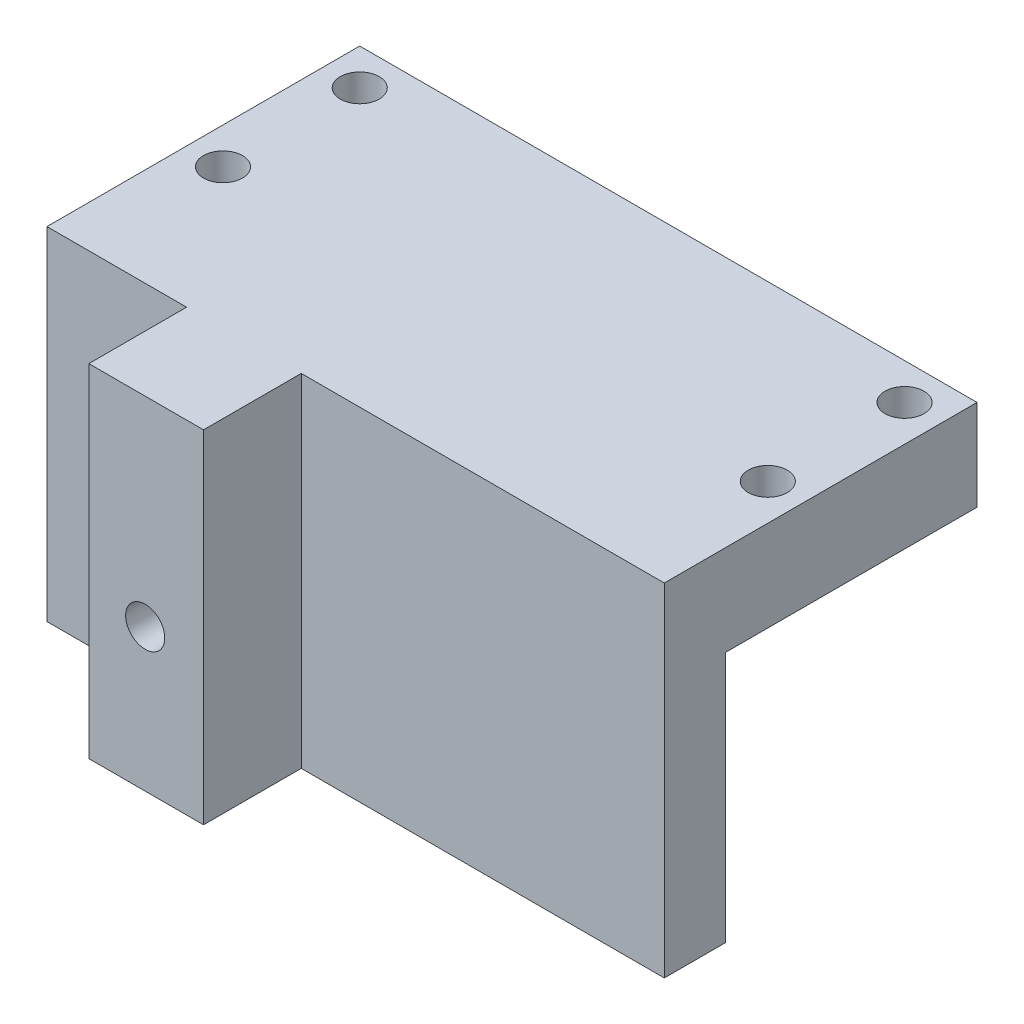
ISO-10303-21;
HEADER;
FILE_DESCRIPTION(('STEP AP214'),'2;1');
FILE_NAME('part.step','',(''),(''),'','','');
FILE_SCHEMA(('AUTOMOTIVE_DESIGN { 1 0 10303 214 1 1 1 1 }'));
ENDSEC;
DATA;
#1=APPLICATION_CONTEXT('core data for automotive mechanical design processes');
#2=APPLICATION_PROTOCOL_DEFINITION('international standard','automotive_design',2000,#1);
#3=PRODUCT_CONTEXT('',#1,'mechanical');
#4=PRODUCT('Part','Part','',(#3));
#5=PRODUCT_RELATED_PRODUCT_CATEGORY('part','',(#4));
#6=PRODUCT_DEFINITION_FORMATION('','',#4);
#7=PRODUCT_DEFINITION_CONTEXT('part definition',#1,'design');
#8=PRODUCT_DEFINITION('design','',#6,#7);
#9=PRODUCT_DEFINITION_SHAPE('','',#8);
#10=(LENGTH_UNIT() NAMED_UNIT(*) SI_UNIT(.MILLI.,.METRE.));
#11=(NAMED_UNIT(*) PLANE_ANGLE_UNIT() SI_UNIT($,.RADIAN.));
#12=(NAMED_UNIT(*) SI_UNIT($,.STERADIAN.) SOLID_ANGLE_UNIT());
#13=UNCERTAINTY_MEASURE_WITH_UNIT(LENGTH_MEASURE(1.E-05),#10,'distance_accuracy_value','');
#14=(GEOMETRIC_REPRESENTATION_CONTEXT(3) GLOBAL_UNCERTAINTY_ASSIGNED_CONTEXT((#13)) GLOBAL_UNIT_ASSIGNED_CONTEXT((#10,
#11,#12)) REPRESENTATION_CONTEXT('',''));
#15=CARTESIAN_POINT('',(0.,0.,0.));
#16=DIRECTION('',(0.,0.,1.));
#17=DIRECTION('',(1.,0.,0.));
#18=AXIS2_PLACEMENT_3D('',#15,#16,#17);
#19=CARTESIAN_POINT('',(0.,-2.54,0.));
#20=DIRECTION('',(0.,-1.,0.));
#21=DIRECTION('',(0.,0.,-1.));
#22=AXIS2_PLACEMENT_3D('',#19,#20,#21);
#23=PLANE('',#22);
#24=CARTESIAN_POINT('',(3.29800000000001,-2.54,-9.664));
#25=DIRECTION('',(0.,-1.,0.));
#26=DIRECTION('',(0.,0.,-1.));
#27=AXIS2_PLACEMENT_3D('',#24,#25,#26);
#28=CIRCLE('',#27,1.774);
#29=CARTESIAN_POINT('',(3.29800000000001,-2.54,-11.438));
#30=VERTEX_POINT('',#29);
#31=EDGE_CURVE('E257',#30,#30,#28,.F.);
#32=ORIENTED_EDGE('',*,*,#31,.T.);
#33=EDGE_LOOP('',(#32));
#34=FACE_BOUND('',#33,.T.);
#35=CARTESIAN_POINT('',(52.852,-2.54,-9.664));
#36=DIRECTION('',(0.,-1.,0.));
#37=DIRECTION('',(0.,0.,-1.));
#38=AXIS2_PLACEMENT_3D('',#35,#36,#37);
#39=CIRCLE('',#38,1.77400000000001);
#40=CARTESIAN_POINT('',(52.852,-2.54,-11.438));
#41=VERTEX_POINT('',#40);
#42=EDGE_CURVE('E249',#41,#41,#39,.T.);
#43=ORIENTED_EDGE('',*,*,#42,.F.);
#44=EDGE_LOOP('',(#43));
#45=FACE_BOUND('',#44,.T.);
#46=CARTESIAN_POINT('',(52.852,-2.54,-22.102));
#47=DIRECTION('',(0.,-1.,0.));
#48=DIRECTION('',(0.,0.,-1.));
#49=AXIS2_PLACEMENT_3D('',#46,#47,#48);
#50=CIRCLE('',#49,1.774);
#51=CARTESIAN_POINT('',(52.852,-2.54,-23.876));
#52=VERTEX_POINT('',#51);
#53=EDGE_CURVE('E248',#52,#52,#50,.T.);
#54=ORIENTED_EDGE('',*,*,#53,.F.);
#55=EDGE_LOOP('',(#54));
#56=FACE_BOUND('',#55,.T.);
#57=CARTESIAN_POINT('',(3.298,-2.54,-22.102));
#58=DIRECTION('',(0.,-1.,0.));
#59=DIRECTION('',(0.,0.,-1.));
#60=AXIS2_PLACEMENT_3D('',#57,#58,#59);
#61=CIRCLE('',#60,1.774);
#62=CARTESIAN_POINT('',(3.298,-2.54,-23.876));
#63=VERTEX_POINT('',#62);
#64=EDGE_CURVE('E240',#63,#63,#61,.F.);
#65=ORIENTED_EDGE('',*,*,#64,.T.);
#66=EDGE_LOOP('',(#65));
#67=FACE_BOUND('',#66,.T.);
#68=DIRECTION('',(1.,0.,0.));
#69=VECTOR('',#68,1.);
#70=CARTESIAN_POINT('',(12.7,-2.54,-16.637));
#71=LINE('',#70,#69);
#72=CARTESIAN_POINT('',(12.7,-2.54,-16.637));
#73=VERTEX_POINT('',#72);
#74=CARTESIAN_POINT('',(23.13,-2.54,-16.637));
#75=VERTEX_POINT('',#74);
#76=EDGE_CURVE('E147',#73,#75,#71,.T.);
#77=ORIENTED_EDGE('',*,*,#76,.F.);
#78=DIRECTION('',(0.,0.,1.));
#79=VECTOR('',#78,1.);
#80=CARTESIAN_POINT('',(12.7,-2.54,-16.637));
#81=LINE('',#80,#79);
#82=CARTESIAN_POINT('',(12.7,-2.54,-2.54));
#83=VERTEX_POINT('',#82);
#84=EDGE_CURVE('E156',#73,#83,#81,.T.);
#85=ORIENTED_EDGE('',*,*,#84,.T.);
#86=DIRECTION('',(-1.,0.,0.));
#87=VECTOR('',#86,1.);
#88=CARTESIAN_POINT('',(0.,-2.54,-2.54));
#89=LINE('',#88,#87);
#90=CARTESIAN_POINT('',(0.,-2.54,-2.54));
#91=VERTEX_POINT('',#90);
#92=EDGE_CURVE('E303',#83,#91,#89,.T.);
#93=ORIENTED_EDGE('',*,*,#92,.T.);
#94=DIRECTION('',(0.,0.,1.));
#95=VECTOR('',#94,1.);
#96=CARTESIAN_POINT('',(0.,-2.54,0.));
#97=LINE('',#96,#95);
#98=CARTESIAN_POINT('',(0.,-2.54,-25.4));
#99=VERTEX_POINT('',#98);
#100=EDGE_CURVE('E310',#99,#91,#97,.T.);
#101=ORIENTED_EDGE('',*,*,#100,.F.);
#102=DIRECTION('',(-1.,0.,0.));
#103=VECTOR('',#102,1.);
#104=CARTESIAN_POINT('',(0.,-2.54,-25.4));
#105=LINE('',#104,#103);
#106=CARTESIAN_POINT('',(56.15,-2.54,-25.4));
#107=VERTEX_POINT('',#106);
#108=EDGE_CURVE('E317',#107,#99,#105,.T.);
#109=ORIENTED_EDGE('',*,*,#108,.F.);
#110=DIRECTION('',(0.,0.,-1.));
#111=VECTOR('',#110,1.);
#112=CARTESIAN_POINT('',(56.15,-2.54,0.));
#113=LINE('',#112,#111);
#114=CARTESIAN_POINT('',(56.15,-2.54,-2.54));
#115=VERTEX_POINT('',#114);
#116=EDGE_CURVE('E314',#115,#107,#113,.T.);
#117=ORIENTED_EDGE('',*,*,#116,.F.);
#118=CARTESIAN_POINT('',(23.13,-2.54,-2.54));
#119=VERTEX_POINT('',#118);
#120=EDGE_CURVE('E307',#115,#119,#89,.T.);
#121=ORIENTED_EDGE('',*,*,#120,.T.);
#122=DIRECTION('',(0.,0.,1.));
#123=VECTOR('',#122,1.);
#124=CARTESIAN_POINT('',(23.13,-2.54,-16.637));
#125=LINE('',#124,#123);
#126=EDGE_CURVE('E164',#75,#119,#125,.T.);
#127=ORIENTED_EDGE('',*,*,#126,.F.);
#128=EDGE_LOOP('',(#77,#85,#93,#101,#109,#117,#121,#127));
#129=FACE_BOUND('',#128,.T.);
#130=ADVANCED_FACE('F40',(#34,#45,#56,#67,#129),#23,.T.);
#131=CARTESIAN_POINT('',(0.,0.,-2.54));
#132=DIRECTION('',(0.,0.,1.));
#133=DIRECTION('',(1.,0.,0.));
#134=AXIS2_PLACEMENT_3D('',#131,#132,#133);
#135=PLANE('',#134);
#136=DIRECTION('',(0.,1.,0.));
#137=VECTOR('',#136,1.);
#138=CARTESIAN_POINT('',(12.7,-25.4,-2.54));
#139=LINE('',#138,#137);
#140=CARTESIAN_POINT('',(12.7,-25.4,-2.54));
#141=VERTEX_POINT('',#140);
#142=EDGE_CURVE('E159',#141,#83,#139,.T.);
#143=ORIENTED_EDGE('',*,*,#142,.F.);
#144=DIRECTION('',(1.,0.,0.));
#145=VECTOR('',#144,1.);
#146=CARTESIAN_POINT('',(0.,-25.4,-2.54));
#147=LINE('',#146,#145);
#148=CARTESIAN_POINT('',(0.,-25.4,-2.54));
#149=VERTEX_POINT('',#148);
#150=EDGE_CURVE('E290',#149,#141,#147,.T.);
#151=ORIENTED_EDGE('',*,*,#150,.F.);
#152=DIRECTION('',(0.,-1.,0.));
#153=VECTOR('',#152,1.);
#154=CARTESIAN_POINT('',(0.,0.,-2.54));
#155=LINE('',#154,#153);
#156=EDGE_CURVE('E286',#91,#149,#155,.T.);
#157=ORIENTED_EDGE('',*,*,#156,.F.);
#158=ORIENTED_EDGE('',*,*,#92,.F.);
#159=EDGE_LOOP('',(#143,#151,#157,#158));
#160=FACE_BOUND('',#159,.T.);
#161=ADVANCED_FACE('F366',(#160),#135,.F.);
#162=DIRECTION('',(0.,-1.,0.));
#163=VECTOR('',#162,1.);
#164=CARTESIAN_POINT('',(23.13,-25.4,-2.54));
#165=LINE('',#164,#163);
#166=CARTESIAN_POINT('',(23.13,-25.4,-2.54));
#167=VERTEX_POINT('',#166);
#168=EDGE_CURVE('E153',#119,#167,#165,.T.);
#169=ORIENTED_EDGE('',*,*,#168,.F.);
#170=ORIENTED_EDGE('',*,*,#120,.F.);
#171=DIRECTION('',(0.,1.,0.));
#172=VECTOR('',#171,1.);
#173=CARTESIAN_POINT('',(56.15,0.,-2.54));
#174=LINE('',#173,#172);
#175=CARTESIAN_POINT('',(56.15,-25.4,-2.54));
#176=VERTEX_POINT('',#175);
#177=EDGE_CURVE('E294',#176,#115,#174,.T.);
#178=ORIENTED_EDGE('',*,*,#177,.F.);
#179=EDGE_CURVE('E289',#167,#176,#147,.T.);
#180=ORIENTED_EDGE('',*,*,#179,.F.);
#181=EDGE_LOOP('',(#169,#170,#178,#180));
#182=FACE_BOUND('',#181,.T.);
#183=ADVANCED_FACE('F368',(#182),#135,.F.);
#184=CARTESIAN_POINT('',(0.,5.715,0.));
#185=DIRECTION('',(0.,1.,0.));
#186=DIRECTION('',(0.,0.,1.));
#187=AXIS2_PLACEMENT_3D('',#184,#185,#186);
#188=PLANE('',#187);
#189=DIRECTION('',(1.,0.,0.));
#190=VECTOR('',#189,1.);
#191=CARTESIAN_POINT('',(56.15,5.715,3.04799999999987));
#192=LINE('',#191,#190);
#193=CARTESIAN_POINT('',(23.13,5.715,3.04799999999986));
#194=VERTEX_POINT('',#193);
#195=CARTESIAN_POINT('',(56.15,5.715,3.04799999999987));
#196=VERTEX_POINT('',#195);
#197=EDGE_CURVE('E190',#194,#196,#192,.T.);
#198=ORIENTED_EDGE('',*,*,#197,.T.);
#199=DIRECTION('',(0.,0.,-1.));
#200=VECTOR('',#199,1.);
#201=CARTESIAN_POINT('',(56.15,5.715,0.));
#202=LINE('',#201,#200);
#203=CARTESIAN_POINT('',(56.15,5.715,-25.4));
#204=VERTEX_POINT('',#203);
#205=EDGE_CURVE('E272',#196,#204,#202,.T.);
#206=ORIENTED_EDGE('',*,*,#205,.T.);
#207=DIRECTION('',(-1.,0.,0.));
#208=VECTOR('',#207,1.);
#209=CARTESIAN_POINT('',(56.15,5.715,-25.4));
#210=LINE('',#209,#208);
#211=CARTESIAN_POINT('',(0.,5.715,-25.4));
#212=VERTEX_POINT('',#211);
#213=EDGE_CURVE('E278',#204,#212,#210,.T.);
#214=ORIENTED_EDGE('',*,*,#213,.T.);
#215=DIRECTION('',(0.,0.,1.));
#216=VECTOR('',#215,1.);
#217=CARTESIAN_POINT('',(0.,5.715,0.));
#218=LINE('',#217,#216);
#219=CARTESIAN_POINT('',(0.,5.715,3.04799999999987));
#220=VERTEX_POINT('',#219);
#221=EDGE_CURVE('E282',#212,#220,#218,.T.);
#222=ORIENTED_EDGE('',*,*,#221,.T.);
#223=DIRECTION('',(1.,0.,0.));
#224=VECTOR('',#223,1.);
#225=CARTESIAN_POINT('',(0.,5.715,3.04799999999987));
#226=LINE('',#225,#224);
#227=CARTESIAN_POINT('',(12.7,5.715,3.04799999999987));
#228=VERTEX_POINT('',#227);
#229=EDGE_CURVE('E213',#220,#228,#226,.T.);
#230=ORIENTED_EDGE('',*,*,#229,.T.);
#231=DIRECTION('',(0.,0.,1.));
#232=VECTOR('',#231,1.);
#233=CARTESIAN_POINT('',(12.7,5.715,11.9379999999999));
#234=LINE('',#233,#232);
#235=CARTESIAN_POINT('',(12.7,5.715,11.9379999999999));
#236=VERTEX_POINT('',#235);
#237=EDGE_CURVE('E217',#228,#236,#234,.T.);
#238=ORIENTED_EDGE('',*,*,#237,.T.);
#239=DIRECTION('',(-1.,0.,0.));
#240=VECTOR('',#239,1.);
#241=CARTESIAN_POINT('',(56.15,5.715,11.9379999999999));
#242=LINE('',#241,#240);
#243=CARTESIAN_POINT('',(23.13,5.715,11.9379999999999));
#244=VERTEX_POINT('',#243);
#245=EDGE_CURVE('E236',#244,#236,#242,.T.);
#246=ORIENTED_EDGE('',*,*,#245,.F.);
#247=DIRECTION('',(0.,0.,-1.));
#248=VECTOR('',#247,1.);
#249=CARTESIAN_POINT('',(23.13,5.715,11.9379999999999));
#250=LINE('',#249,#248);
#251=EDGE_CURVE('E66',#244,#194,#250,.T.);
#252=ORIENTED_EDGE('',*,*,#251,.T.);
#253=EDGE_LOOP('',(#198,#206,#214,#222,#230,#238,#246,#252));
#254=FACE_BOUND('',#253,.T.);
#255=CARTESIAN_POINT('',(3.29800000000001,5.715,-9.664));
#256=DIRECTION('',(0.,-1.,0.));
#257=DIRECTION('',(0.,0.,-1.));
#258=AXIS2_PLACEMENT_3D('',#255,#256,#257);
#259=CIRCLE('',#258,1.774);
#260=CARTESIAN_POINT('',(3.29800000000001,5.715,-11.438));
#261=VERTEX_POINT('',#260);
#262=EDGE_CURVE('E253',#261,#261,#259,.F.);
#263=ORIENTED_EDGE('',*,*,#262,.F.);
#264=EDGE_LOOP('',(#263));
#265=FACE_BOUND('',#264,.T.);
#266=CARTESIAN_POINT('',(52.852,5.715,-9.664));
#267=DIRECTION('',(0.,-1.,0.));
#268=DIRECTION('',(0.,0.,-1.));
#269=AXIS2_PLACEMENT_3D('',#266,#267,#268);
#270=CIRCLE('',#269,1.77400000000001);
#271=CARTESIAN_POINT('',(52.852,5.715,-11.438));
#272=VERTEX_POINT('',#271);
#273=EDGE_CURVE('E244',#272,#272,#270,.T.);
#274=ORIENTED_EDGE('',*,*,#273,.T.);
#275=EDGE_LOOP('',(#274));
#276=FACE_BOUND('',#275,.T.);
#277=CARTESIAN_POINT('',(52.852,5.715,-22.102));
#278=DIRECTION('',(0.,-1.,0.));
#279=DIRECTION('',(0.,0.,-1.));
#280=AXIS2_PLACEMENT_3D('',#277,#278,#279);
#281=CIRCLE('',#280,1.774);
#282=CARTESIAN_POINT('',(52.852,5.715,-23.876));
#283=VERTEX_POINT('',#282);
#284=EDGE_CURVE('E268',#283,#283,#281,.T.);
#285=ORIENTED_EDGE('',*,*,#284,.T.);
#286=EDGE_LOOP('',(#285));
#287=FACE_BOUND('',#286,.T.);
#288=CARTESIAN_POINT('',(3.298,5.715,-22.102));
#289=DIRECTION('',(0.,-1.,0.));
#290=DIRECTION('',(0.,0.,-1.));
#291=AXIS2_PLACEMENT_3D('',#288,#289,#290);
#292=CIRCLE('',#291,1.774);
#293=CARTESIAN_POINT('',(3.298,5.715,-23.876));
#294=VERTEX_POINT('',#293);
#295=EDGE_CURVE('E261',#294,#294,#292,.F.);
#296=ORIENTED_EDGE('',*,*,#295,.F.);
#297=EDGE_LOOP('',(#296));
#298=FACE_BOUND('',#297,.T.);
#299=ADVANCED_FACE('F333',(#254,#265,#276,#287,#298),#188,.T.);
#300=CARTESIAN_POINT('',(0.,-2.54,0.));
#301=DIRECTION('',(-1.,0.,0.));
#302=DIRECTION('',(0.,0.,1.));
#303=AXIS2_PLACEMENT_3D('',#300,#301,#302);
#304=PLANE('',#303);
#305=DIRECTION('',(0.,-1.,0.));
#306=VECTOR('',#305,1.);
#307=CARTESIAN_POINT('',(0.,5.715,3.04799999999987));
#308=LINE('',#307,#306);
#309=CARTESIAN_POINT('',(0.,-25.4,3.04799999999987));
#310=VERTEX_POINT('',#309);
#311=EDGE_CURVE('E222',#220,#310,#308,.T.);
#312=ORIENTED_EDGE('',*,*,#311,.F.);
#313=ORIENTED_EDGE('',*,*,#221,.F.);
#314=DIRECTION('',(0.,1.,0.));
#315=VECTOR('',#314,1.);
#316=CARTESIAN_POINT('',(0.,-2.54,-25.4));
#317=LINE('',#316,#315);
#318=EDGE_CURVE('E12',#99,#212,#317,.T.);
#319=ORIENTED_EDGE('',*,*,#318,.F.);
#320=ORIENTED_EDGE('',*,*,#100,.T.);
#321=ORIENTED_EDGE('',*,*,#156,.T.);
#322=DIRECTION('',(0.,0.,1.));
#323=VECTOR('',#322,1.);
#324=CARTESIAN_POINT('',(0.,-25.4,-2.54));
#325=LINE('',#324,#323);
#326=EDGE_CURVE('E298',#149,#310,#325,.T.);
#327=ORIENTED_EDGE('',*,*,#326,.T.);
#328=EDGE_LOOP('',(#312,#313,#319,#320,#321,#327));
#329=FACE_BOUND('',#328,.T.);
#330=ADVANCED_FACE('F42',(#329),#304,.T.);
#331=CARTESIAN_POINT('',(0.,-2.54,-25.4));
#332=DIRECTION('',(0.,0.,-1.));
#333=DIRECTION('',(-1.,0.,0.));
#334=AXIS2_PLACEMENT_3D('',#331,#332,#333);
#335=PLANE('',#334);
#336=ORIENTED_EDGE('',*,*,#318,.T.);
#337=ORIENTED_EDGE('',*,*,#213,.F.);
#338=DIRECTION('',(0.,1.,0.));
#339=VECTOR('',#338,1.);
#340=CARTESIAN_POINT('',(56.15,-2.54,-25.4));
#341=LINE('',#340,#339);
#342=EDGE_CURVE('E50',#107,#204,#341,.T.);
#343=ORIENTED_EDGE('',*,*,#342,.F.);
#344=ORIENTED_EDGE('',*,*,#108,.T.);
#345=EDGE_LOOP('',(#336,#337,#343,#344));
#346=FACE_BOUND('',#345,.T.);
#347=ADVANCED_FACE('F330',(#346),#335,.T.);
#348=CARTESIAN_POINT('',(56.15,-2.54,0.));
#349=DIRECTION('',(1.,0.,0.));
#350=DIRECTION('',(0.,0.,-1.));
#351=AXIS2_PLACEMENT_3D('',#348,#349,#350);
#352=PLANE('',#351);
#353=DIRECTION('',(0.,-1.,0.));
#354=VECTOR('',#353,1.);
#355=CARTESIAN_POINT('',(56.15,5.715,3.04799999999987));
#356=LINE('',#355,#354);
#357=CARTESIAN_POINT('',(56.15,-25.4,3.04799999999987));
#358=VERTEX_POINT('',#357);
#359=EDGE_CURVE('E203',#196,#358,#356,.T.);
#360=ORIENTED_EDGE('',*,*,#359,.T.);
#361=DIRECTION('',(0.,0.,1.));
#362=VECTOR('',#361,1.);
#363=CARTESIAN_POINT('',(56.15,-25.4,-2.54));
#364=LINE('',#363,#362);
#365=EDGE_CURVE('E299',#176,#358,#364,.T.);
#366=ORIENTED_EDGE('',*,*,#365,.F.);
#367=ORIENTED_EDGE('',*,*,#177,.T.);
#368=ORIENTED_EDGE('',*,*,#116,.T.);
#369=ORIENTED_EDGE('',*,*,#342,.T.);
#370=ORIENTED_EDGE('',*,*,#205,.F.);
#371=EDGE_LOOP('',(#360,#366,#367,#368,#369,#370));
#372=FACE_BOUND('',#371,.T.);
#373=ADVANCED_FACE('F326',(#372),#352,.T.);
#374=CARTESIAN_POINT('',(0.,-25.4,-2.54));
#375=DIRECTION('',(0.,-1.,0.));
#376=DIRECTION('',(0.,0.,-1.));
#377=AXIS2_PLACEMENT_3D('',#374,#375,#376);
#378=PLANE('',#377);
#379=DIRECTION('',(1.,0.,0.));
#380=VECTOR('',#379,1.);
#381=CARTESIAN_POINT('',(56.15,-25.4,3.04799999999987));
#382=LINE('',#381,#380);
#383=CARTESIAN_POINT('',(23.13,-25.4,3.04799999999986));
#384=VERTEX_POINT('',#383);
#385=EDGE_CURVE('E191',#384,#358,#382,.T.);
#386=ORIENTED_EDGE('',*,*,#385,.F.);
#387=DIRECTION('',(0.,0.,-1.));
#388=VECTOR('',#387,1.);
#389=CARTESIAN_POINT('',(23.13,-25.4,11.9379999999999));
#390=LINE('',#389,#388);
#391=CARTESIAN_POINT('',(23.13,-25.4,11.9379999999999));
#392=VERTEX_POINT('',#391);
#393=EDGE_CURVE('E196',#392,#384,#390,.T.);
#394=ORIENTED_EDGE('',*,*,#393,.F.);
#395=DIRECTION('',(1.,0.,0.));
#396=VECTOR('',#395,1.);
#397=CARTESIAN_POINT('',(56.15,-25.4,11.9379999999999));
#398=LINE('',#397,#396);
#399=CARTESIAN_POINT('',(12.7,-25.4,11.9379999999999));
#400=VERTEX_POINT('',#399);
#401=EDGE_CURVE('E207',#400,#392,#398,.T.);
#402=ORIENTED_EDGE('',*,*,#401,.F.);
#403=DIRECTION('',(0.,0.,1.));
#404=VECTOR('',#403,1.);
#405=CARTESIAN_POINT('',(12.7,-25.4,11.9379999999999));
#406=LINE('',#405,#404);
#407=CARTESIAN_POINT('',(12.7,-25.4,3.04799999999987));
#408=VERTEX_POINT('',#407);
#409=EDGE_CURVE('E218',#408,#400,#406,.T.);
#410=ORIENTED_EDGE('',*,*,#409,.F.);
#411=DIRECTION('',(1.,0.,0.));
#412=VECTOR('',#411,1.);
#413=CARTESIAN_POINT('',(0.,-25.4,3.04799999999987));
#414=LINE('',#413,#412);
#415=EDGE_CURVE('E163',#310,#408,#414,.T.);
#416=ORIENTED_EDGE('',*,*,#415,.F.);
#417=ORIENTED_EDGE('',*,*,#326,.F.);
#418=ORIENTED_EDGE('',*,*,#150,.T.);
#419=DIRECTION('',(0.,0.,1.));
#420=VECTOR('',#419,1.);
#421=CARTESIAN_POINT('',(12.7,-25.4,-16.637));
#422=LINE('',#421,#420);
#423=CARTESIAN_POINT('',(12.7,-25.4,-16.637));
#424=VERTEX_POINT('',#423);
#425=EDGE_CURVE('E177',#424,#141,#422,.T.);
#426=ORIENTED_EDGE('',*,*,#425,.F.);
#427=DIRECTION('',(-1.,0.,0.));
#428=VECTOR('',#427,1.);
#429=CARTESIAN_POINT('',(12.7,-25.4,-16.637));
#430=LINE('',#429,#428);
#431=CARTESIAN_POINT('',(23.13,-25.4,-16.637));
#432=VERTEX_POINT('',#431);
#433=EDGE_CURVE('E149',#432,#424,#430,.T.);
#434=ORIENTED_EDGE('',*,*,#433,.F.);
#435=DIRECTION('',(0.,0.,1.));
#436=VECTOR('',#435,1.);
#437=CARTESIAN_POINT('',(23.13,-25.4,-16.637));
#438=LINE('',#437,#436);
#439=EDGE_CURVE('E58',#432,#167,#438,.T.);
#440=ORIENTED_EDGE('',*,*,#439,.T.);
#441=ORIENTED_EDGE('',*,*,#179,.T.);
#442=ORIENTED_EDGE('',*,*,#365,.T.);
#443=EDGE_LOOP('',(#386,#394,#402,#410,#416,#417,#418,#426,#434,#440,#441,#442));
#444=FACE_BOUND('',#443,.T.);
#445=ADVANCED_FACE('F344',(#444),#378,.T.);
#446=CARTESIAN_POINT('',(52.852,5.715,-22.102));
#447=DIRECTION('',(0.,-1.,0.));
#448=DIRECTION('',(0.,0.,-1.));
#449=AXIS2_PLACEMENT_3D('',#446,#447,#448);
#450=CYLINDRICAL_SURFACE('',#449,1.774);
#451=ORIENTED_EDGE('',*,*,#284,.F.);
#452=EDGE_LOOP('',(#451));
#453=FACE_BOUND('',#452,.T.);
#454=ORIENTED_EDGE('',*,*,#53,.T.);
#455=EDGE_LOOP('',(#454));
#456=FACE_BOUND('',#455,.T.);
#457=ADVANCED_FACE('F380',(#453,#456),#450,.F.);
#458=CARTESIAN_POINT('',(52.852,5.715,-9.664));
#459=DIRECTION('',(0.,-1.,0.));
#460=DIRECTION('',(0.,0.,-1.));
#461=AXIS2_PLACEMENT_3D('',#458,#459,#460);
#462=CYLINDRICAL_SURFACE('',#461,1.77400000000001);
#463=ORIENTED_EDGE('',*,*,#273,.F.);
#464=EDGE_LOOP('',(#463));
#465=FACE_BOUND('',#464,.T.);
#466=ORIENTED_EDGE('',*,*,#42,.T.);
#467=EDGE_LOOP('',(#466));
#468=FACE_BOUND('',#467,.T.);
#469=ADVANCED_FACE('F403',(#465,#468),#462,.F.);
#470=CARTESIAN_POINT('',(3.29800000000001,5.715,-9.664));
#471=DIRECTION('',(0.,-1.,0.));
#472=DIRECTION('',(0.,0.,-1.));
#473=AXIS2_PLACEMENT_3D('',#470,#471,#472);
#474=CYLINDRICAL_SURFACE('',#473,1.774);
#475=ORIENTED_EDGE('',*,*,#262,.T.);
#476=EDGE_LOOP('',(#475));
#477=FACE_BOUND('',#476,.T.);
#478=ORIENTED_EDGE('',*,*,#31,.F.);
#479=EDGE_LOOP('',(#478));
#480=FACE_BOUND('',#479,.T.);
#481=ADVANCED_FACE('F410',(#477,#480),#474,.F.);
#482=CARTESIAN_POINT('',(3.298,5.715,-22.102));
#483=DIRECTION('',(0.,-1.,0.));
#484=DIRECTION('',(0.,0.,-1.));
#485=AXIS2_PLACEMENT_3D('',#482,#483,#484);
#486=CYLINDRICAL_SURFACE('',#485,1.774);
#487=ORIENTED_EDGE('',*,*,#295,.T.);
#488=EDGE_LOOP('',(#487));
#489=FACE_BOUND('',#488,.T.);
#490=ORIENTED_EDGE('',*,*,#64,.F.);
#491=EDGE_LOOP('',(#490));
#492=FACE_BOUND('',#491,.T.);
#493=ADVANCED_FACE('F418',(#489,#492),#486,.F.);
#494=CARTESIAN_POINT('',(-73.4562499999999,-18.8,11.9379999999999));
#495=DIRECTION('',(0.,0.,1.));
#496=DIRECTION('',(0.,-1.,0.));
#497=AXIS2_PLACEMENT_3D('',#494,#495,#496);
#498=PLANE('',#497);
#499=CARTESIAN_POINT('',(17.8250000000001,-12.45,11.9379999999999));
#500=DIRECTION('',(0.,0.,1.));
#501=DIRECTION('',(1.,0.,0.));
#502=AXIS2_PLACEMENT_3D('',#499,#500,#501);
#503=CIRCLE('',#502,1.778);
#504=CARTESIAN_POINT('',(19.6030000000001,-12.45,11.9379999999999));
#505=VERTEX_POINT('',#504);
#506=EDGE_CURVE('E584',#505,#505,#503,.T.);
#507=ORIENTED_EDGE('',*,*,#506,.F.);
#508=EDGE_LOOP('',(#507));
#509=FACE_BOUND('',#508,.T.);
#510=DIRECTION('',(0.,-1.,0.));
#511=VECTOR('',#510,1.);
#512=CARTESIAN_POINT('',(23.13,5.715,11.9379999999999));
#513=LINE('',#512,#511);
#514=EDGE_CURVE('E195',#244,#392,#513,.T.);
#515=ORIENTED_EDGE('',*,*,#514,.F.);
#516=ORIENTED_EDGE('',*,*,#245,.T.);
#517=DIRECTION('',(0.,-1.,0.));
#518=VECTOR('',#517,1.);
#519=CARTESIAN_POINT('',(12.7,5.715,11.9379999999999));
#520=LINE('',#519,#518);
#521=EDGE_CURVE('E200',#236,#400,#520,.T.);
#522=ORIENTED_EDGE('',*,*,#521,.T.);
#523=ORIENTED_EDGE('',*,*,#401,.T.);
#524=EDGE_LOOP('',(#515,#516,#522,#523));
#525=FACE_BOUND('',#524,.T.);
#526=ADVANCED_FACE('F352',(#509,#525),#498,.T.);
#527=CARTESIAN_POINT('',(12.7,5.715,11.9379999999999));
#528=DIRECTION('',(1.,0.,0.));
#529=DIRECTION('',(0.,0.,-1.));
#530=AXIS2_PLACEMENT_3D('',#527,#528,#529);
#531=PLANE('',#530);
#532=ORIENTED_EDGE('',*,*,#409,.T.);
#533=ORIENTED_EDGE('',*,*,#521,.F.);
#534=ORIENTED_EDGE('',*,*,#237,.F.);
#535=DIRECTION('',(0.,-1.,0.));
#536=VECTOR('',#535,1.);
#537=CARTESIAN_POINT('',(12.7,5.715,3.04799999999987));
#538=LINE('',#537,#536);
#539=EDGE_CURVE('E231',#228,#408,#538,.T.);
#540=ORIENTED_EDGE('',*,*,#539,.T.);
#541=EDGE_LOOP('',(#532,#533,#534,#540));
#542=FACE_BOUND('',#541,.T.);
#543=ADVANCED_FACE('F349',(#542),#531,.F.);
#544=CARTESIAN_POINT('',(0.,5.715,3.04799999999987));
#545=DIRECTION('',(0.,0.,-1.));
#546=DIRECTION('',(-1.,0.,0.));
#547=AXIS2_PLACEMENT_3D('',#544,#545,#546);
#548=PLANE('',#547);
#549=ORIENTED_EDGE('',*,*,#415,.T.);
#550=ORIENTED_EDGE('',*,*,#539,.F.);
#551=ORIENTED_EDGE('',*,*,#229,.F.);
#552=ORIENTED_EDGE('',*,*,#311,.T.);
#553=EDGE_LOOP('',(#549,#550,#551,#552));
#554=FACE_BOUND('',#553,.T.);
#555=ADVANCED_FACE('F341',(#554),#548,.F.);
#556=CARTESIAN_POINT('',(56.15,5.715,3.04799999999987));
#557=DIRECTION('',(0.,0.,-1.));
#558=DIRECTION('',(-1.,0.,0.));
#559=AXIS2_PLACEMENT_3D('',#556,#557,#558);
#560=PLANE('',#559);
#561=ORIENTED_EDGE('',*,*,#385,.T.);
#562=ORIENTED_EDGE('',*,*,#359,.F.);
#563=ORIENTED_EDGE('',*,*,#197,.F.);
#564=DIRECTION('',(0.,-1.,0.));
#565=VECTOR('',#564,1.);
#566=CARTESIAN_POINT('',(23.13,5.715,3.04799999999986));
#567=LINE('',#566,#565);
#568=EDGE_CURVE('E208',#194,#384,#567,.T.);
#569=ORIENTED_EDGE('',*,*,#568,.T.);
#570=EDGE_LOOP('',(#561,#562,#563,#569));
#571=FACE_BOUND('',#570,.T.);
#572=ADVANCED_FACE('F356',(#571),#560,.F.);
#573=CARTESIAN_POINT('',(23.13,5.715,11.9379999999999));
#574=DIRECTION('',(-1.,0.,0.));
#575=DIRECTION('',(0.,0.,1.));
#576=AXIS2_PLACEMENT_3D('',#573,#574,#575);
#577=PLANE('',#576);
#578=ORIENTED_EDGE('',*,*,#393,.T.);
#579=ORIENTED_EDGE('',*,*,#568,.F.);
#580=ORIENTED_EDGE('',*,*,#251,.F.);
#581=ORIENTED_EDGE('',*,*,#514,.T.);
#582=EDGE_LOOP('',(#578,#579,#580,#581));
#583=FACE_BOUND('',#582,.T.);
#584=ADVANCED_FACE('F454',(#583),#577,.F.);
#585=CARTESIAN_POINT('',(12.7,-25.4,-16.637));
#586=DIRECTION('',(1.,0.,0.));
#587=DIRECTION('',(0.,0.,-1.));
#588=AXIS2_PLACEMENT_3D('',#585,#586,#587);
#589=PLANE('',#588);
#590=ORIENTED_EDGE('',*,*,#142,.T.);
#591=ORIENTED_EDGE('',*,*,#84,.F.);
#592=DIRECTION('',(0.,1.,0.));
#593=VECTOR('',#592,1.);
#594=CARTESIAN_POINT('',(12.7,-25.4,-16.637));
#595=LINE('',#594,#593);
#596=EDGE_CURVE('E143',#424,#73,#595,.T.);
#597=ORIENTED_EDGE('',*,*,#596,.F.);
#598=ORIENTED_EDGE('',*,*,#425,.T.);
#599=EDGE_LOOP('',(#590,#591,#597,#598));
#600=FACE_BOUND('',#599,.T.);
#601=ADVANCED_FACE('F157',(#600),#589,.F.);
#602=CARTESIAN_POINT('',(23.13,-25.4,-16.637));
#603=DIRECTION('',(-1.,0.,0.));
#604=DIRECTION('',(0.,-1.,0.));
#605=AXIS2_PLACEMENT_3D('',#602,#603,#604);
#606=PLANE('',#605);
#607=ORIENTED_EDGE('',*,*,#168,.T.);
#608=ORIENTED_EDGE('',*,*,#439,.F.);
#609=DIRECTION('',(0.,-1.,0.));
#610=VECTOR('',#609,1.);
#611=CARTESIAN_POINT('',(23.13,-25.4,-16.637));
#612=LINE('',#611,#610);
#613=EDGE_CURVE('E169',#75,#432,#612,.T.);
#614=ORIENTED_EDGE('',*,*,#613,.F.);
#615=ORIENTED_EDGE('',*,*,#126,.T.);
#616=EDGE_LOOP('',(#607,#608,#614,#615));
#617=FACE_BOUND('',#616,.T.);
#618=ADVANCED_FACE('F467',(#617),#606,.F.);
#619=CARTESIAN_POINT('',(0.,0.,-16.637));
#620=DIRECTION('',(0.,0.,-1.));
#621=DIRECTION('',(-1.,0.,0.));
#622=AXIS2_PLACEMENT_3D('',#619,#620,#621);
#623=PLANE('',#622);
#624=CARTESIAN_POINT('',(17.8250000000001,-12.45,-16.637));
#625=DIRECTION('',(0.,0.,-1.));
#626=DIRECTION('',(-1.,0.,0.));
#627=AXIS2_PLACEMENT_3D('',#624,#625,#626);
#628=CIRCLE('',#627,1.778);
#629=CARTESIAN_POINT('',(16.0470000000001,-12.45,-16.637));
#630=VERTEX_POINT('',#629);
#631=EDGE_CURVE('E44',#630,#630,#628,.T.);
#632=ORIENTED_EDGE('',*,*,#631,.F.);
#633=EDGE_LOOP('',(#632));
#634=FACE_BOUND('',#633,.T.);
#635=ORIENTED_EDGE('',*,*,#596,.T.);
#636=ORIENTED_EDGE('',*,*,#76,.T.);
#637=ORIENTED_EDGE('',*,*,#613,.T.);
#638=ORIENTED_EDGE('',*,*,#433,.T.);
#639=EDGE_LOOP('',(#635,#636,#637,#638));
#640=FACE_BOUND('',#639,.T.);
#641=ADVANCED_FACE('F145',(#634,#640),#623,.T.);
#642=CARTESIAN_POINT('',(17.8250000000001,-12.45,-25.4));
#643=DIRECTION('',(0.,0.,1.));
#644=DIRECTION('',(1.,0.,0.));
#645=AXIS2_PLACEMENT_3D('',#642,#643,#644);
#646=CYLINDRICAL_SURFACE('',#645,1.778);
#647=ORIENTED_EDGE('',*,*,#631,.T.);
#648=EDGE_LOOP('',(#647));
#649=FACE_BOUND('',#648,.T.);
#650=ORIENTED_EDGE('',*,*,#506,.T.);
#651=EDGE_LOOP('',(#650));
#652=FACE_BOUND('',#651,.T.);
#653=ADVANCED_FACE('F479',(#649,#652),#646,.F.);
#654=CLOSED_SHELL('',(#130,#161,#183,#299,#330,#347,#373,#445,#457,#469,#481,#493,#526,#543,
#555,#572,#584,#601,#618,#641,#653));
#655=MANIFOLD_SOLID_BREP('B2',#654);
#656=ADVANCED_BREP_SHAPE_REPRESENTATION('',(#18,#655),#14);
#657=SHAPE_DEFINITION_REPRESENTATION(#9,#656);
ENDSEC;
END-ISO-10303-21;
